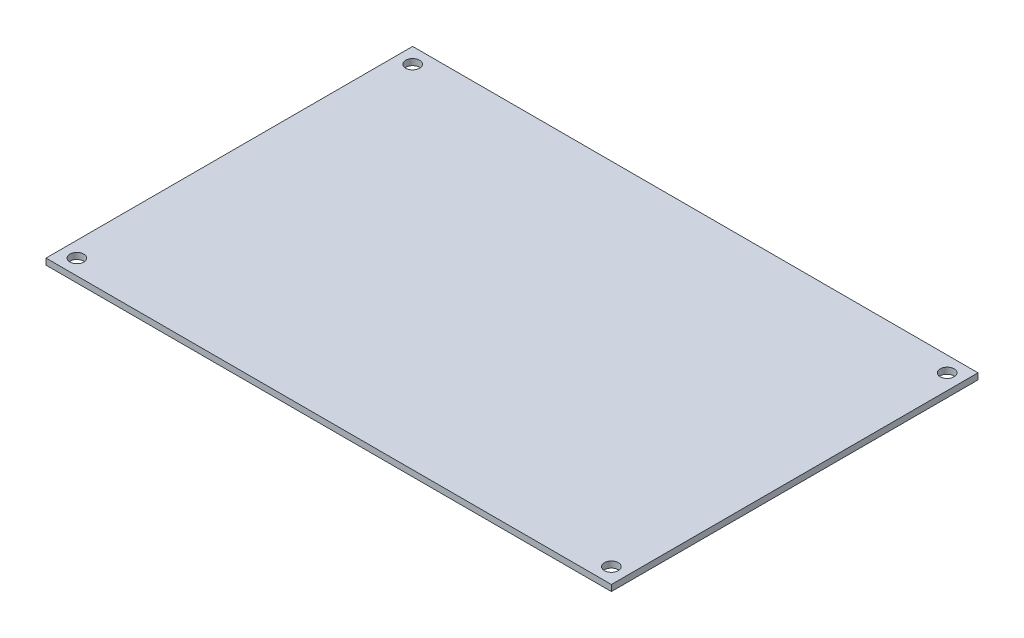
ISO-10303-21;
HEADER;
FILE_DESCRIPTION(('STEP AP214'),'2;1');
FILE_NAME('part.step','',(''),(''),'','','');
FILE_SCHEMA(('AUTOMOTIVE_DESIGN { 1 0 10303 214 1 1 1 1 }'));
ENDSEC;
DATA;
#1=APPLICATION_CONTEXT('core data for automotive mechanical design processes');
#2=APPLICATION_PROTOCOL_DEFINITION('international standard','automotive_design',2000,#1);
#3=PRODUCT_CONTEXT('',#1,'mechanical');
#4=PRODUCT('Part','Part','',(#3));
#5=PRODUCT_RELATED_PRODUCT_CATEGORY('part','',(#4));
#6=PRODUCT_DEFINITION_FORMATION('','',#4);
#7=PRODUCT_DEFINITION_CONTEXT('part definition',#1,'design');
#8=PRODUCT_DEFINITION('design','',#6,#7);
#9=PRODUCT_DEFINITION_SHAPE('','',#8);
#10=(LENGTH_UNIT() NAMED_UNIT(*) SI_UNIT(.MILLI.,.METRE.));
#11=(NAMED_UNIT(*) PLANE_ANGLE_UNIT() SI_UNIT($,.RADIAN.));
#12=(NAMED_UNIT(*) SI_UNIT($,.STERADIAN.) SOLID_ANGLE_UNIT());
#13=UNCERTAINTY_MEASURE_WITH_UNIT(LENGTH_MEASURE(1.E-05),#10,'distance_accuracy_value','');
#14=(GEOMETRIC_REPRESENTATION_CONTEXT(3) GLOBAL_UNCERTAINTY_ASSIGNED_CONTEXT((#13)) GLOBAL_UNIT_ASSIGNED_CONTEXT((#10,
#11,#12)) REPRESENTATION_CONTEXT('',''));
#15=CARTESIAN_POINT('',(0.,0.,0.));
#16=DIRECTION('',(0.,0.,1.));
#17=DIRECTION('',(1.,0.,0.));
#18=AXIS2_PLACEMENT_3D('',#15,#16,#17);
#19=CARTESIAN_POINT('',(-73.25,-1.6,-47.5));
#20=DIRECTION('',(-1.,0.,0.));
#21=DIRECTION('',(0.,0.,1.));
#22=AXIS2_PLACEMENT_3D('',#19,#20,#21);
#23=PLANE('',#22);
#24=DIRECTION('',(0.,0.,1.));
#25=VECTOR('',#24,1.);
#26=CARTESIAN_POINT('',(-73.25,0.,-47.5));
#27=LINE('',#26,#25);
#28=CARTESIAN_POINT('',(-73.25,0.,-47.5));
#29=VERTEX_POINT('',#28);
#30=CARTESIAN_POINT('',(-73.25,0.,47.5));
#31=VERTEX_POINT('',#30);
#32=EDGE_CURVE('E113',#29,#31,#27,.T.);
#33=ORIENTED_EDGE('',*,*,#32,.F.);
#34=DIRECTION('',(0.,1.,0.));
#35=VECTOR('',#34,1.);
#36=CARTESIAN_POINT('',(-73.25,-1.6,-47.5));
#37=LINE('',#36,#35);
#38=CARTESIAN_POINT('',(-73.25,-1.6,-47.5));
#39=VERTEX_POINT('',#38);
#40=EDGE_CURVE('E11',#39,#29,#37,.T.);
#41=ORIENTED_EDGE('',*,*,#40,.F.);
#42=DIRECTION('',(0.,0.,1.));
#43=VECTOR('',#42,1.);
#44=CARTESIAN_POINT('',(-73.25,-1.6,-47.5));
#45=LINE('',#44,#43);
#46=CARTESIAN_POINT('',(-73.25,-1.6,47.5));
#47=VERTEX_POINT('',#46);
#48=EDGE_CURVE('E102',#39,#47,#45,.T.);
#49=ORIENTED_EDGE('',*,*,#48,.T.);
#50=DIRECTION('',(0.,1.,0.));
#51=VECTOR('',#50,1.);
#52=CARTESIAN_POINT('',(-73.25,-1.6,47.5));
#53=LINE('',#52,#51);
#54=EDGE_CURVE('E43',#47,#31,#53,.T.);
#55=ORIENTED_EDGE('',*,*,#54,.T.);
#56=EDGE_LOOP('',(#33,#41,#49,#55));
#57=FACE_BOUND('',#56,.T.);
#58=ADVANCED_FACE('F40',(#57),#23,.T.);
#59=CARTESIAN_POINT('',(-73.25,-1.6,-47.5));
#60=DIRECTION('',(0.,0.,-1.));
#61=DIRECTION('',(-1.,0.,0.));
#62=AXIS2_PLACEMENT_3D('',#59,#60,#61);
#63=PLANE('',#62);
#64=DIRECTION('',(-1.,0.,0.));
#65=VECTOR('',#64,1.);
#66=CARTESIAN_POINT('',(-73.25,0.,-47.5));
#67=LINE('',#66,#65);
#68=CARTESIAN_POINT('',(73.25,0.,-47.5));
#69=VERTEX_POINT('',#68);
#70=EDGE_CURVE('E107',#69,#29,#67,.T.);
#71=ORIENTED_EDGE('',*,*,#70,.F.);
#72=DIRECTION('',(0.,1.,0.));
#73=VECTOR('',#72,1.);
#74=CARTESIAN_POINT('',(73.25,-1.6,-47.5));
#75=LINE('',#74,#73);
#76=CARTESIAN_POINT('',(73.25,-1.6,-47.5));
#77=VERTEX_POINT('',#76);
#78=EDGE_CURVE('E50',#77,#69,#75,.T.);
#79=ORIENTED_EDGE('',*,*,#78,.F.);
#80=DIRECTION('',(-1.,0.,0.));
#81=VECTOR('',#80,1.);
#82=CARTESIAN_POINT('',(-73.25,-1.6,-47.5));
#83=LINE('',#82,#81);
#84=EDGE_CURVE('E98',#77,#39,#83,.T.);
#85=ORIENTED_EDGE('',*,*,#84,.T.);
#86=ORIENTED_EDGE('',*,*,#40,.T.);
#87=EDGE_LOOP('',(#71,#79,#85,#86));
#88=FACE_BOUND('',#87,.T.);
#89=ADVANCED_FACE('F126',(#88),#63,.T.);
#90=CARTESIAN_POINT('',(73.25,-1.6,-47.5));
#91=DIRECTION('',(1.,0.,0.));
#92=DIRECTION('',(0.,0.,-1.));
#93=AXIS2_PLACEMENT_3D('',#90,#91,#92);
#94=PLANE('',#93);
#95=DIRECTION('',(0.,0.,-1.));
#96=VECTOR('',#95,1.);
#97=CARTESIAN_POINT('',(73.25,0.,-47.5));
#98=LINE('',#97,#96);
#99=CARTESIAN_POINT('',(73.25,0.,47.5));
#100=VERTEX_POINT('',#99);
#101=EDGE_CURVE('E93',#100,#69,#98,.T.);
#102=ORIENTED_EDGE('',*,*,#101,.F.);
#103=DIRECTION('',(0.,1.,0.));
#104=VECTOR('',#103,1.);
#105=CARTESIAN_POINT('',(73.25,-1.6,47.5));
#106=LINE('',#105,#104);
#107=CARTESIAN_POINT('',(73.25,-1.6,47.5));
#108=VERTEX_POINT('',#107);
#109=EDGE_CURVE('E88',#108,#100,#106,.T.);
#110=ORIENTED_EDGE('',*,*,#109,.F.);
#111=DIRECTION('',(0.,0.,-1.));
#112=VECTOR('',#111,1.);
#113=CARTESIAN_POINT('',(73.25,-1.6,-47.5));
#114=LINE('',#113,#112);
#115=EDGE_CURVE('E91',#108,#77,#114,.T.);
#116=ORIENTED_EDGE('',*,*,#115,.T.);
#117=ORIENTED_EDGE('',*,*,#78,.T.);
#118=EDGE_LOOP('',(#102,#110,#116,#117));
#119=FACE_BOUND('',#118,.T.);
#120=ADVANCED_FACE('F90',(#119),#94,.T.);
#121=CARTESIAN_POINT('',(-73.25,-1.6,47.5));
#122=DIRECTION('',(0.,0.,1.));
#123=DIRECTION('',(1.,0.,0.));
#124=AXIS2_PLACEMENT_3D('',#121,#122,#123);
#125=PLANE('',#124);
#126=DIRECTION('',(1.,0.,0.));
#127=VECTOR('',#126,1.);
#128=CARTESIAN_POINT('',(-73.25,0.,47.5));
#129=LINE('',#128,#127);
#130=EDGE_CURVE('E116',#31,#100,#129,.T.);
#131=ORIENTED_EDGE('',*,*,#130,.F.);
#132=ORIENTED_EDGE('',*,*,#54,.F.);
#133=DIRECTION('',(1.,0.,0.));
#134=VECTOR('',#133,1.);
#135=CARTESIAN_POINT('',(-73.25,-1.6,47.5));
#136=LINE('',#135,#134);
#137=EDGE_CURVE('E97',#47,#108,#136,.T.);
#138=ORIENTED_EDGE('',*,*,#137,.T.);
#139=ORIENTED_EDGE('',*,*,#109,.T.);
#140=EDGE_LOOP('',(#131,#132,#138,#139));
#141=FACE_BOUND('',#140,.T.);
#142=ADVANCED_FACE('F100',(#141),#125,.T.);
#143=CARTESIAN_POINT('',(0.,-1.6,0.));
#144=DIRECTION('',(0.,1.,0.));
#145=DIRECTION('',(0.,0.,1.));
#146=AXIS2_PLACEMENT_3D('',#143,#144,#145);
#147=PLANE('',#146);
#148=CARTESIAN_POINT('',(-69.25,-1.6,43.5));
#149=DIRECTION('',(0.,1.,0.));
#150=DIRECTION('',(0.,0.,1.));
#151=AXIS2_PLACEMENT_3D('',#148,#149,#150);
#152=CIRCLE('',#151,1.79999999999999);
#153=CARTESIAN_POINT('',(-69.25,-1.6,45.3));
#154=VERTEX_POINT('',#153);
#155=EDGE_CURVE('E167',#154,#154,#152,.T.);
#156=ORIENTED_EDGE('',*,*,#155,.T.);
#157=EDGE_LOOP('',(#156));
#158=FACE_BOUND('',#157,.T.);
#159=CARTESIAN_POINT('',(69.25,-1.6,43.5));
#160=DIRECTION('',(0.,1.,0.));
#161=DIRECTION('',(0.,0.,1.));
#162=AXIS2_PLACEMENT_3D('',#159,#160,#161);
#163=CIRCLE('',#162,1.79999999999999);
#164=CARTESIAN_POINT('',(69.25,-1.6,45.3));
#165=VERTEX_POINT('',#164);
#166=EDGE_CURVE('E175',#165,#165,#163,.T.);
#167=ORIENTED_EDGE('',*,*,#166,.T.);
#168=EDGE_LOOP('',(#167));
#169=FACE_BOUND('',#168,.T.);
#170=CARTESIAN_POINT('',(69.25,-1.6,-43.5));
#171=DIRECTION('',(0.,1.,0.));
#172=DIRECTION('',(0.,0.,1.));
#173=AXIS2_PLACEMENT_3D('',#170,#171,#172);
#174=CIRCLE('',#173,1.79999999999999);
#175=CARTESIAN_POINT('',(69.25,-1.6,-41.7));
#176=VERTEX_POINT('',#175);
#177=EDGE_CURVE('E181',#176,#176,#174,.T.);
#178=ORIENTED_EDGE('',*,*,#177,.T.);
#179=EDGE_LOOP('',(#178));
#180=FACE_BOUND('',#179,.T.);
#181=CARTESIAN_POINT('',(-69.25,-1.6,-43.5));
#182=DIRECTION('',(0.,1.,0.));
#183=DIRECTION('',(0.,0.,1.));
#184=AXIS2_PLACEMENT_3D('',#181,#182,#183);
#185=CIRCLE('',#184,1.79999999999999);
#186=CARTESIAN_POINT('',(-69.25,-1.6,-41.7));
#187=VERTEX_POINT('',#186);
#188=EDGE_CURVE('E117',#187,#187,#185,.T.);
#189=ORIENTED_EDGE('',*,*,#188,.T.);
#190=EDGE_LOOP('',(#189));
#191=FACE_BOUND('',#190,.T.);
#192=ORIENTED_EDGE('',*,*,#48,.F.);
#193=ORIENTED_EDGE('',*,*,#84,.F.);
#194=ORIENTED_EDGE('',*,*,#115,.F.);
#195=ORIENTED_EDGE('',*,*,#137,.F.);
#196=EDGE_LOOP('',(#192,#193,#194,#195));
#197=FACE_BOUND('',#196,.T.);
#198=ADVANCED_FACE('F96',(#158,#169,#180,#191,#197),#147,.F.);
#199=CARTESIAN_POINT('',(0.,0.,0.));
#200=DIRECTION('',(0.,1.,0.));
#201=DIRECTION('',(0.,0.,1.));
#202=AXIS2_PLACEMENT_3D('',#199,#200,#201);
#203=PLANE('',#202);
#204=CARTESIAN_POINT('',(-69.25,0.,43.5));
#205=DIRECTION('',(0.,1.,0.));
#206=DIRECTION('',(0.,0.,1.));
#207=AXIS2_PLACEMENT_3D('',#204,#205,#206);
#208=CIRCLE('',#207,1.79999999999999);
#209=CARTESIAN_POINT('',(-69.25,0.,45.3));
#210=VERTEX_POINT('',#209);
#211=EDGE_CURVE('E170',#210,#210,#208,.T.);
#212=ORIENTED_EDGE('',*,*,#211,.F.);
#213=EDGE_LOOP('',(#212));
#214=FACE_BOUND('',#213,.T.);
#215=CARTESIAN_POINT('',(69.25,0.,43.5));
#216=DIRECTION('',(0.,1.,0.));
#217=DIRECTION('',(0.,0.,1.));
#218=AXIS2_PLACEMENT_3D('',#215,#216,#217);
#219=CIRCLE('',#218,1.79999999999999);
#220=CARTESIAN_POINT('',(69.25,0.,45.3));
#221=VERTEX_POINT('',#220);
#222=EDGE_CURVE('E172',#221,#221,#219,.T.);
#223=ORIENTED_EDGE('',*,*,#222,.F.);
#224=EDGE_LOOP('',(#223));
#225=FACE_BOUND('',#224,.T.);
#226=CARTESIAN_POINT('',(69.25,0.,-43.5));
#227=DIRECTION('',(0.,1.,0.));
#228=DIRECTION('',(0.,0.,1.));
#229=AXIS2_PLACEMENT_3D('',#226,#227,#228);
#230=CIRCLE('',#229,1.79999999999999);
#231=CARTESIAN_POINT('',(69.25,0.,-41.7));
#232=VERTEX_POINT('',#231);
#233=EDGE_CURVE('E178',#232,#232,#230,.T.);
#234=ORIENTED_EDGE('',*,*,#233,.F.);
#235=EDGE_LOOP('',(#234));
#236=FACE_BOUND('',#235,.T.);
#237=CARTESIAN_POINT('',(-69.25,0.,-43.5));
#238=DIRECTION('',(0.,1.,0.));
#239=DIRECTION('',(0.,0.,1.));
#240=AXIS2_PLACEMENT_3D('',#237,#238,#239);
#241=CIRCLE('',#240,1.79999999999999);
#242=CARTESIAN_POINT('',(-69.25,0.,-41.7));
#243=VERTEX_POINT('',#242);
#244=EDGE_CURVE('E184',#243,#243,#241,.T.);
#245=ORIENTED_EDGE('',*,*,#244,.F.);
#246=EDGE_LOOP('',(#245));
#247=FACE_BOUND('',#246,.T.);
#248=ORIENTED_EDGE('',*,*,#32,.T.);
#249=ORIENTED_EDGE('',*,*,#130,.T.);
#250=ORIENTED_EDGE('',*,*,#101,.T.);
#251=ORIENTED_EDGE('',*,*,#70,.T.);
#252=EDGE_LOOP('',(#248,#249,#250,#251));
#253=FACE_BOUND('',#252,.T.);
#254=ADVANCED_FACE('F125',(#214,#225,#236,#247,#253),#203,.T.);
#255=CARTESIAN_POINT('',(-69.25,-1.6,-43.5));
#256=DIRECTION('',(0.,1.,0.));
#257=DIRECTION('',(0.,0.,1.));
#258=AXIS2_PLACEMENT_3D('',#255,#256,#257);
#259=CYLINDRICAL_SURFACE('',#258,1.79999999999999);
#260=ORIENTED_EDGE('',*,*,#188,.F.);
#261=EDGE_LOOP('',(#260));
#262=FACE_BOUND('',#261,.T.);
#263=ORIENTED_EDGE('',*,*,#244,.T.);
#264=EDGE_LOOP('',(#263));
#265=FACE_BOUND('',#264,.T.);
#266=ADVANCED_FACE('F144',(#262,#265),#259,.F.);
#267=CARTESIAN_POINT('',(69.25,-1.6,-43.5));
#268=DIRECTION('',(0.,1.,0.));
#269=DIRECTION('',(0.,0.,1.));
#270=AXIS2_PLACEMENT_3D('',#267,#268,#269);
#271=CYLINDRICAL_SURFACE('',#270,1.79999999999999);
#272=ORIENTED_EDGE('',*,*,#177,.F.);
#273=EDGE_LOOP('',(#272));
#274=FACE_BOUND('',#273,.T.);
#275=ORIENTED_EDGE('',*,*,#233,.T.);
#276=EDGE_LOOP('',(#275));
#277=FACE_BOUND('',#276,.T.);
#278=ADVANCED_FACE('F151',(#274,#277),#271,.F.);
#279=CARTESIAN_POINT('',(69.25,-1.6,43.5));
#280=DIRECTION('',(0.,1.,0.));
#281=DIRECTION('',(0.,0.,1.));
#282=AXIS2_PLACEMENT_3D('',#279,#280,#281);
#283=CYLINDRICAL_SURFACE('',#282,1.79999999999999);
#284=ORIENTED_EDGE('',*,*,#166,.F.);
#285=EDGE_LOOP('',(#284));
#286=FACE_BOUND('',#285,.T.);
#287=ORIENTED_EDGE('',*,*,#222,.T.);
#288=EDGE_LOOP('',(#287));
#289=FACE_BOUND('',#288,.T.);
#290=ADVANCED_FACE('F155',(#286,#289),#283,.F.);
#291=CARTESIAN_POINT('',(-69.25,-1.6,43.5));
#292=DIRECTION('',(0.,1.,0.));
#293=DIRECTION('',(0.,0.,1.));
#294=AXIS2_PLACEMENT_3D('',#291,#292,#293);
#295=CYLINDRICAL_SURFACE('',#294,1.79999999999999);
#296=ORIENTED_EDGE('',*,*,#155,.F.);
#297=EDGE_LOOP('',(#296));
#298=FACE_BOUND('',#297,.T.);
#299=ORIENTED_EDGE('',*,*,#211,.T.);
#300=EDGE_LOOP('',(#299));
#301=FACE_BOUND('',#300,.T.);
#302=ADVANCED_FACE('F159',(#298,#301),#295,.F.);
#303=CLOSED_SHELL('',(#58,#89,#120,#142,#198,#254,#266,#278,#290,#302));
#304=MANIFOLD_SOLID_BREP('B2',#303);
#305=ADVANCED_BREP_SHAPE_REPRESENTATION('',(#18,#304),#14);
#306=SHAPE_DEFINITION_REPRESENTATION(#9,#305);
ENDSEC;
END-ISO-10303-21;
